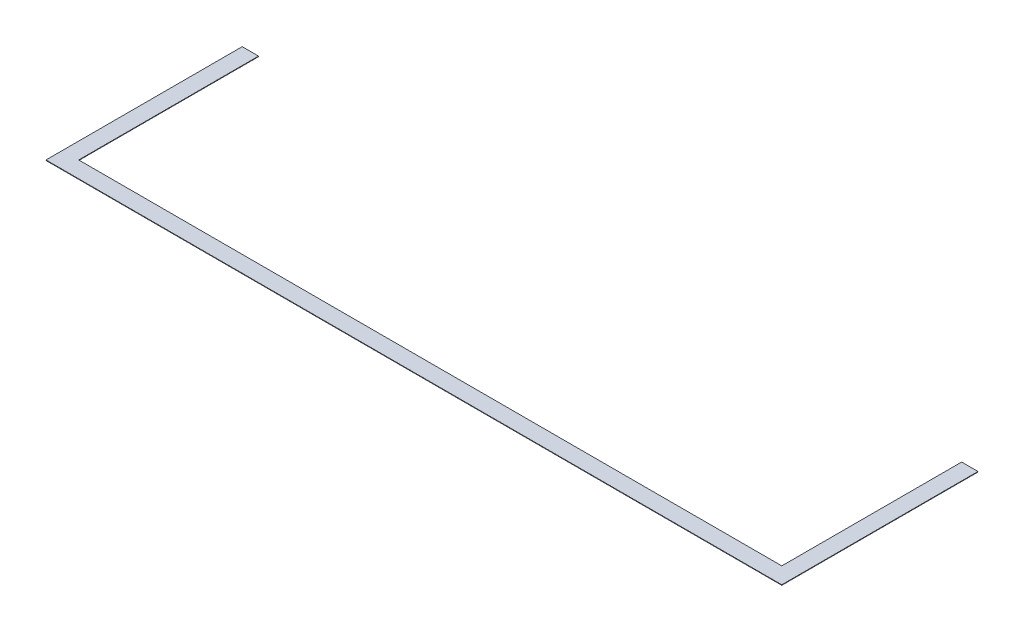
ISO-10303-21;
HEADER;
FILE_DESCRIPTION(('STEP AP214'),'2;1');
FILE_NAME('part.step','',(''),(''),'','','');
FILE_SCHEMA(('AUTOMOTIVE_DESIGN { 1 0 10303 214 1 1 1 1 }'));
ENDSEC;
DATA;
#1=APPLICATION_CONTEXT('core data for automotive mechanical design processes');
#2=APPLICATION_PROTOCOL_DEFINITION('international standard','automotive_design',2000,#1);
#3=PRODUCT_CONTEXT('',#1,'mechanical');
#4=PRODUCT('Part','Part','',(#3));
#5=PRODUCT_RELATED_PRODUCT_CATEGORY('part','',(#4));
#6=PRODUCT_DEFINITION_FORMATION('','',#4);
#7=PRODUCT_DEFINITION_CONTEXT('part definition',#1,'design');
#8=PRODUCT_DEFINITION('design','',#6,#7);
#9=PRODUCT_DEFINITION_SHAPE('','',#8);
#10=(LENGTH_UNIT() NAMED_UNIT(*) SI_UNIT(.MILLI.,.METRE.));
#11=(NAMED_UNIT(*) PLANE_ANGLE_UNIT() SI_UNIT($,.RADIAN.));
#12=(NAMED_UNIT(*) SI_UNIT($,.STERADIAN.) SOLID_ANGLE_UNIT());
#13=UNCERTAINTY_MEASURE_WITH_UNIT(LENGTH_MEASURE(1.E-05),#10,'distance_accuracy_value','');
#14=(GEOMETRIC_REPRESENTATION_CONTEXT(3) GLOBAL_UNCERTAINTY_ASSIGNED_CONTEXT((#13)) GLOBAL_UNIT_ASSIGNED_CONTEXT((#10,
#11,#12)) REPRESENTATION_CONTEXT('',''));
#15=CARTESIAN_POINT('',(0.,0.,0.));
#16=DIRECTION('',(0.,0.,1.));
#17=DIRECTION('',(1.,0.,0.));
#18=AXIS2_PLACEMENT_3D('',#15,#16,#17);
#19=CARTESIAN_POINT('',(0.,0.,0.));
#20=DIRECTION('',(0.,1.,0.));
#21=DIRECTION('',(0.,0.,1.));
#22=AXIS2_PLACEMENT_3D('',#19,#20,#21);
#23=PLANE('',#22);
#24=DIRECTION('',(0.,0.,1.));
#25=VECTOR('',#24,1.);
#26=CARTESIAN_POINT('',(50.8000000000002,0.,0.));
#27=LINE('',#26,#25);
#28=CARTESIAN_POINT('',(50.8,0.,0.));
#29=VERTEX_POINT('',#28);
#30=CARTESIAN_POINT('',(50.8000000000002,0.,558.8));
#31=VERTEX_POINT('',#30);
#32=EDGE_CURVE('E181',#29,#31,#27,.T.);
#33=ORIENTED_EDGE('',*,*,#32,.T.);
#34=DIRECTION('',(-1.,0.,0.));
#35=VECTOR('',#34,1.);
#36=CARTESIAN_POINT('',(0.,0.,558.8));
#37=LINE('',#36,#35);
#38=CARTESIAN_POINT('',(2235.2,0.,558.799999999999));
#39=VERTEX_POINT('',#38);
#40=EDGE_CURVE('E194',#39,#31,#37,.T.);
#41=ORIENTED_EDGE('',*,*,#40,.F.);
#42=DIRECTION('',(0.,0.,1.));
#43=VECTOR('',#42,1.);
#44=CARTESIAN_POINT('',(2235.2,0.,0.));
#45=LINE('',#44,#43);
#46=CARTESIAN_POINT('',(2235.2,0.,-1.84651795170424E-13));
#47=VERTEX_POINT('',#46);
#48=EDGE_CURVE('E132',#47,#39,#45,.T.);
#49=ORIENTED_EDGE('',*,*,#48,.F.);
#50=DIRECTION('',(-1.,0.,0.));
#51=VECTOR('',#50,1.);
#52=CARTESIAN_POINT('',(0.,0.,0.));
#53=LINE('',#52,#51);
#54=CARTESIAN_POINT('',(2286.,0.,-1.94289029309402E-13));
#55=VERTEX_POINT('',#54);
#56=EDGE_CURVE('E172',#55,#47,#53,.T.);
#57=ORIENTED_EDGE('',*,*,#56,.F.);
#58=DIRECTION('',(0.,0.,-1.));
#59=VECTOR('',#58,1.);
#60=CARTESIAN_POINT('',(2286.,0.,0.));
#61=LINE('',#60,#59);
#62=CARTESIAN_POINT('',(2286.,0.,609.6));
#63=VERTEX_POINT('',#62);
#64=EDGE_CURVE('E190',#63,#55,#61,.T.);
#65=ORIENTED_EDGE('',*,*,#64,.F.);
#66=DIRECTION('',(1.,0.,0.));
#67=VECTOR('',#66,1.);
#68=CARTESIAN_POINT('',(0.,0.,609.6));
#69=LINE('',#68,#67);
#70=CARTESIAN_POINT('',(0.,0.,609.6));
#71=VERTEX_POINT('',#70);
#72=EDGE_CURVE('E188',#71,#63,#69,.T.);
#73=ORIENTED_EDGE('',*,*,#72,.F.);
#74=DIRECTION('',(0.,0.,1.));
#75=VECTOR('',#74,1.);
#76=CARTESIAN_POINT('',(0.,0.,0.));
#77=LINE('',#76,#75);
#78=CARTESIAN_POINT('',(0.,0.,0.));
#79=VERTEX_POINT('',#78);
#80=EDGE_CURVE('E186',#79,#71,#77,.T.);
#81=ORIENTED_EDGE('',*,*,#80,.F.);
#82=DIRECTION('',(-1.,0.,0.));
#83=VECTOR('',#82,1.);
#84=CARTESIAN_POINT('',(0.,0.,0.));
#85=LINE('',#84,#83);
#86=EDGE_CURVE('E184',#29,#79,#85,.T.);
#87=ORIENTED_EDGE('',*,*,#86,.F.);
#88=EDGE_LOOP('',(#33,#41,#49,#57,#65,#73,#81,#87));
#89=FACE_BOUND('',#88,.T.);
#90=ADVANCED_FACE('F87',(#89),#23,.F.);
#91=CARTESIAN_POINT('',(0.,1.5875,558.8));
#92=DIRECTION('',(0.,0.,1.));
#93=DIRECTION('',(1.,0.,0.));
#94=AXIS2_PLACEMENT_3D('',#91,#92,#93);
#95=PLANE('',#94);
#96=ORIENTED_EDGE('',*,*,#40,.T.);
#97=DIRECTION('',(0.,-1.,0.));
#98=VECTOR('',#97,1.);
#99=CARTESIAN_POINT('',(50.8000000000002,1.5875,558.8));
#100=LINE('',#99,#98);
#101=CARTESIAN_POINT('',(50.8000000000002,1.5875,558.8));
#102=VERTEX_POINT('',#101);
#103=EDGE_CURVE('E139',#102,#31,#100,.T.);
#104=ORIENTED_EDGE('',*,*,#103,.F.);
#105=DIRECTION('',(-1.,0.,0.));
#106=VECTOR('',#105,1.);
#107=CARTESIAN_POINT('',(0.,1.5875,558.8));
#108=LINE('',#107,#106);
#109=CARTESIAN_POINT('',(2235.2,1.5875,558.799999999999));
#110=VERTEX_POINT('',#109);
#111=EDGE_CURVE('E104',#110,#102,#108,.T.);
#112=ORIENTED_EDGE('',*,*,#111,.F.);
#113=DIRECTION('',(0.,-1.,0.));
#114=VECTOR('',#113,1.);
#115=CARTESIAN_POINT('',(2235.2,1.5875,558.799999999999));
#116=LINE('',#115,#114);
#117=EDGE_CURVE('E174',#110,#39,#116,.T.);
#118=ORIENTED_EDGE('',*,*,#117,.T.);
#119=EDGE_LOOP('',(#96,#104,#112,#118));
#120=FACE_BOUND('',#119,.T.);
#121=ADVANCED_FACE('F237',(#120),#95,.F.);
#122=CARTESIAN_POINT('',(2235.2,1.5875,0.));
#123=DIRECTION('',(1.,0.,0.));
#124=DIRECTION('',(0.,0.,-1.));
#125=AXIS2_PLACEMENT_3D('',#122,#123,#124);
#126=PLANE('',#125);
#127=ORIENTED_EDGE('',*,*,#48,.T.);
#128=ORIENTED_EDGE('',*,*,#117,.F.);
#129=DIRECTION('',(0.,0.,1.));
#130=VECTOR('',#129,1.);
#131=CARTESIAN_POINT('',(2235.2,1.5875,0.));
#132=LINE('',#131,#130);
#133=CARTESIAN_POINT('',(2235.2,1.5875,-1.84651795170424E-13));
#134=VERTEX_POINT('',#133);
#135=EDGE_CURVE('E162',#134,#110,#132,.T.);
#136=ORIENTED_EDGE('',*,*,#135,.F.);
#137=DIRECTION('',(0.,-1.,0.));
#138=VECTOR('',#137,1.);
#139=CARTESIAN_POINT('',(2235.2,1.5875,-1.84651795170424E-13));
#140=LINE('',#139,#138);
#141=EDGE_CURVE('E169',#134,#47,#140,.T.);
#142=ORIENTED_EDGE('',*,*,#141,.T.);
#143=EDGE_LOOP('',(#127,#128,#136,#142));
#144=FACE_BOUND('',#143,.T.);
#145=ADVANCED_FACE('F176',(#144),#126,.F.);
#146=CARTESIAN_POINT('',(0.,1.5875,0.));
#147=DIRECTION('',(0.,0.,1.));
#148=DIRECTION('',(1.,0.,0.));
#149=AXIS2_PLACEMENT_3D('',#146,#147,#148);
#150=PLANE('',#149);
#151=ORIENTED_EDGE('',*,*,#56,.T.);
#152=ORIENTED_EDGE('',*,*,#141,.F.);
#153=DIRECTION('',(-1.,0.,0.));
#154=VECTOR('',#153,1.);
#155=CARTESIAN_POINT('',(0.,1.5875,0.));
#156=LINE('',#155,#154);
#157=CARTESIAN_POINT('',(2286.,1.5875,-1.94289029309402E-13));
#158=VERTEX_POINT('',#157);
#159=EDGE_CURVE('E158',#158,#134,#156,.T.);
#160=ORIENTED_EDGE('',*,*,#159,.F.);
#161=DIRECTION('',(0.,-1.,0.));
#162=VECTOR('',#161,1.);
#163=CARTESIAN_POINT('',(2286.,1.5875,-1.94289029309402E-13));
#164=LINE('',#163,#162);
#165=EDGE_CURVE('E173',#158,#55,#164,.T.);
#166=ORIENTED_EDGE('',*,*,#165,.T.);
#167=EDGE_LOOP('',(#151,#152,#160,#166));
#168=FACE_BOUND('',#167,.T.);
#169=ADVANCED_FACE('F170',(#168),#150,.F.);
#170=CARTESIAN_POINT('',(2286.,1.5875,0.));
#171=DIRECTION('',(-1.,0.,0.));
#172=DIRECTION('',(0.,0.,1.));
#173=AXIS2_PLACEMENT_3D('',#170,#171,#172);
#174=PLANE('',#173);
#175=ORIENTED_EDGE('',*,*,#64,.T.);
#176=ORIENTED_EDGE('',*,*,#165,.F.);
#177=DIRECTION('',(0.,0.,-1.));
#178=VECTOR('',#177,1.);
#179=CARTESIAN_POINT('',(2286.,1.5875,0.));
#180=LINE('',#179,#178);
#181=CARTESIAN_POINT('',(2286.,1.5875,609.6));
#182=VERTEX_POINT('',#181);
#183=EDGE_CURVE('E164',#182,#158,#180,.T.);
#184=ORIENTED_EDGE('',*,*,#183,.F.);
#185=DIRECTION('',(0.,-1.,0.));
#186=VECTOR('',#185,1.);
#187=CARTESIAN_POINT('',(2286.,1.5875,609.6));
#188=LINE('',#187,#186);
#189=EDGE_CURVE('E200',#182,#63,#188,.T.);
#190=ORIENTED_EDGE('',*,*,#189,.T.);
#191=EDGE_LOOP('',(#175,#176,#184,#190));
#192=FACE_BOUND('',#191,.T.);
#193=ADVANCED_FACE('F223',(#192),#174,.F.);
#194=CARTESIAN_POINT('',(0.,1.5875,609.6));
#195=DIRECTION('',(0.,0.,-1.));
#196=DIRECTION('',(-1.,0.,0.));
#197=AXIS2_PLACEMENT_3D('',#194,#195,#196);
#198=PLANE('',#197);
#199=ORIENTED_EDGE('',*,*,#72,.T.);
#200=ORIENTED_EDGE('',*,*,#189,.F.);
#201=DIRECTION('',(1.,0.,0.));
#202=VECTOR('',#201,1.);
#203=CARTESIAN_POINT('',(0.,1.5875,609.6));
#204=LINE('',#203,#202);
#205=CARTESIAN_POINT('',(0.,1.5875,609.6));
#206=VERTEX_POINT('',#205);
#207=EDGE_CURVE('E224',#206,#182,#204,.T.);
#208=ORIENTED_EDGE('',*,*,#207,.F.);
#209=DIRECTION('',(0.,-1.,0.));
#210=VECTOR('',#209,1.);
#211=CARTESIAN_POINT('',(0.,1.5875,609.6));
#212=LINE('',#211,#210);
#213=EDGE_CURVE('E203',#206,#71,#212,.T.);
#214=ORIENTED_EDGE('',*,*,#213,.T.);
#215=EDGE_LOOP('',(#199,#200,#208,#214));
#216=FACE_BOUND('',#215,.T.);
#217=ADVANCED_FACE('F220',(#216),#198,.F.);
#218=CARTESIAN_POINT('',(0.,1.5875,0.));
#219=DIRECTION('',(1.,0.,0.));
#220=DIRECTION('',(0.,0.,-1.));
#221=AXIS2_PLACEMENT_3D('',#218,#219,#220);
#222=PLANE('',#221);
#223=ORIENTED_EDGE('',*,*,#80,.T.);
#224=ORIENTED_EDGE('',*,*,#213,.F.);
#225=DIRECTION('',(0.,0.,1.));
#226=VECTOR('',#225,1.);
#227=CARTESIAN_POINT('',(0.,1.5875,0.));
#228=LINE('',#227,#226);
#229=CARTESIAN_POINT('',(0.,1.5875,0.));
#230=VERTEX_POINT('',#229);
#231=EDGE_CURVE('E212',#230,#206,#228,.T.);
#232=ORIENTED_EDGE('',*,*,#231,.F.);
#233=DIRECTION('',(0.,-1.,0.));
#234=VECTOR('',#233,1.);
#235=CARTESIAN_POINT('',(0.,1.5875,0.));
#236=LINE('',#235,#234);
#237=EDGE_CURVE('E96',#230,#79,#236,.T.);
#238=ORIENTED_EDGE('',*,*,#237,.T.);
#239=EDGE_LOOP('',(#223,#224,#232,#238));
#240=FACE_BOUND('',#239,.T.);
#241=ADVANCED_FACE('F210',(#240),#222,.F.);
#242=CARTESIAN_POINT('',(0.,1.5875,0.));
#243=DIRECTION('',(0.,0.,1.));
#244=DIRECTION('',(1.,0.,0.));
#245=AXIS2_PLACEMENT_3D('',#242,#243,#244);
#246=PLANE('',#245);
#247=ORIENTED_EDGE('',*,*,#86,.T.);
#248=ORIENTED_EDGE('',*,*,#237,.F.);
#249=DIRECTION('',(-1.,0.,0.));
#250=VECTOR('',#249,1.);
#251=CARTESIAN_POINT('',(0.,1.5875,0.));
#252=LINE('',#251,#250);
#253=CARTESIAN_POINT('',(50.8,1.5875,0.));
#254=VERTEX_POINT('',#253);
#255=EDGE_CURVE('E228',#254,#230,#252,.T.);
#256=ORIENTED_EDGE('',*,*,#255,.F.);
#257=DIRECTION('',(0.,-1.,0.));
#258=VECTOR('',#257,1.);
#259=CARTESIAN_POINT('',(50.8,1.5875,0.));
#260=LINE('',#259,#258);
#261=EDGE_CURVE('E12',#254,#29,#260,.T.);
#262=ORIENTED_EDGE('',*,*,#261,.T.);
#263=EDGE_LOOP('',(#247,#248,#256,#262));
#264=FACE_BOUND('',#263,.T.);
#265=ADVANCED_FACE('F230',(#264),#246,.F.);
#266=CARTESIAN_POINT('',(50.8000000000002,1.5875,0.));
#267=DIRECTION('',(1.,0.,0.));
#268=DIRECTION('',(0.,0.,-1.));
#269=AXIS2_PLACEMENT_3D('',#266,#267,#268);
#270=PLANE('',#269);
#271=ORIENTED_EDGE('',*,*,#32,.F.);
#272=ORIENTED_EDGE('',*,*,#261,.F.);
#273=DIRECTION('',(0.,0.,1.));
#274=VECTOR('',#273,1.);
#275=CARTESIAN_POINT('',(50.8000000000002,1.5875,0.));
#276=LINE('',#275,#274);
#277=EDGE_CURVE('E196',#254,#102,#276,.T.);
#278=ORIENTED_EDGE('',*,*,#277,.T.);
#279=ORIENTED_EDGE('',*,*,#103,.T.);
#280=EDGE_LOOP('',(#271,#272,#278,#279));
#281=FACE_BOUND('',#280,.T.);
#282=ADVANCED_FACE('F89',(#281),#270,.T.);
#283=CARTESIAN_POINT('',(0.,1.5875,0.));
#284=DIRECTION('',(0.,1.,0.));
#285=DIRECTION('',(0.,0.,1.));
#286=AXIS2_PLACEMENT_3D('',#283,#284,#285);
#287=PLANE('',#286);
#288=ORIENTED_EDGE('',*,*,#277,.F.);
#289=ORIENTED_EDGE('',*,*,#255,.T.);
#290=ORIENTED_EDGE('',*,*,#231,.T.);
#291=ORIENTED_EDGE('',*,*,#207,.T.);
#292=ORIENTED_EDGE('',*,*,#183,.T.);
#293=ORIENTED_EDGE('',*,*,#159,.T.);
#294=ORIENTED_EDGE('',*,*,#135,.T.);
#295=ORIENTED_EDGE('',*,*,#111,.T.);
#296=EDGE_LOOP('',(#288,#289,#290,#291,#292,#293,#294,#295));
#297=FACE_BOUND('',#296,.T.);
#298=ADVANCED_FACE('F160',(#297),#287,.T.);
#299=CLOSED_SHELL('',(#90,#121,#145,#169,#193,#217,#241,#265,#282,#298));
#300=MANIFOLD_SOLID_BREP('B2',#299);
#301=ADVANCED_BREP_SHAPE_REPRESENTATION('',(#18,#300),#14);
#302=SHAPE_DEFINITION_REPRESENTATION(#9,#301);
ENDSEC;
END-ISO-10303-21;
